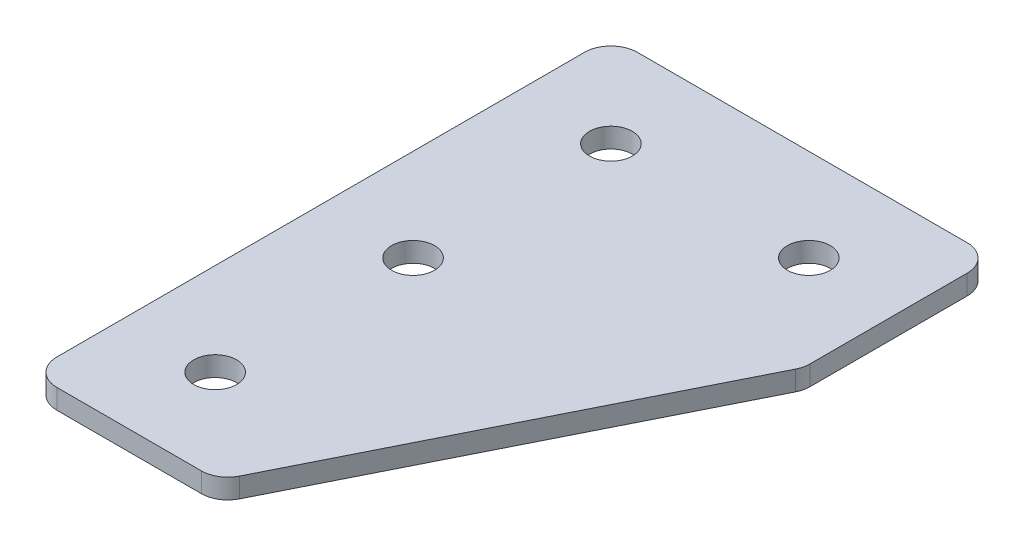
ISO-10303-21;
HEADER;
FILE_DESCRIPTION(('STEP AP214'),'2;1');
FILE_NAME('part.step','',(''),(''),'','','');
FILE_SCHEMA(('AUTOMOTIVE_DESIGN { 1 0 10303 214 1 1 1 1 }'));
ENDSEC;
DATA;
#1=APPLICATION_CONTEXT('core data for automotive mechanical design processes');
#2=APPLICATION_PROTOCOL_DEFINITION('international standard','automotive_design',2000,#1);
#3=PRODUCT_CONTEXT('',#1,'mechanical');
#4=PRODUCT('Part','Part','',(#3));
#5=PRODUCT_RELATED_PRODUCT_CATEGORY('part','',(#4));
#6=PRODUCT_DEFINITION_FORMATION('','',#4);
#7=PRODUCT_DEFINITION_CONTEXT('part definition',#1,'design');
#8=PRODUCT_DEFINITION('design','',#6,#7);
#9=PRODUCT_DEFINITION_SHAPE('','',#8);
#10=(LENGTH_UNIT() NAMED_UNIT(*) SI_UNIT(.MILLI.,.METRE.));
#11=(NAMED_UNIT(*) PLANE_ANGLE_UNIT() SI_UNIT($,.RADIAN.));
#12=(NAMED_UNIT(*) SI_UNIT($,.STERADIAN.) SOLID_ANGLE_UNIT());
#13=UNCERTAINTY_MEASURE_WITH_UNIT(LENGTH_MEASURE(1.E-05),#10,'distance_accuracy_value','');
#14=(GEOMETRIC_REPRESENTATION_CONTEXT(3) GLOBAL_UNCERTAINTY_ASSIGNED_CONTEXT((#13)) GLOBAL_UNIT_ASSIGNED_CONTEXT((#10,
#11,#12)) REPRESENTATION_CONTEXT('',''));
#15=CARTESIAN_POINT('',(0.,0.,0.));
#16=DIRECTION('',(0.,0.,1.));
#17=DIRECTION('',(1.,0.,0.));
#18=AXIS2_PLACEMENT_3D('',#15,#16,#17);
#19=CARTESIAN_POINT('',(-8.92451364331455,1.52470932668439,-15.8498260094711));
#20=DIRECTION('',(0.,-1.,0.));
#21=DIRECTION('',(0.,0.,-1.));
#22=AXIS2_PLACEMENT_3D('',#19,#20,#21);
#23=PLANE('',#22);
#24=CARTESIAN_POINT('',(-8.92451364331456,1.52470932668439,14.1501739905289));
#25=DIRECTION('',(0.,1.,0.));
#26=DIRECTION('',(0.,0.,1.));
#27=AXIS2_PLACEMENT_3D('',#24,#25,#26);
#28=CIRCLE('',#27,1.625);
#29=CARTESIAN_POINT('',(-8.92451364331456,1.52470932668439,15.7751739905289));
#30=VERTEX_POINT('',#29);
#31=EDGE_CURVE('E249',#30,#30,#28,.T.);
#32=ORIENTED_EDGE('',*,*,#31,.T.);
#33=EDGE_LOOP('',(#32));
#34=FACE_BOUND('',#33,.T.);
#35=CARTESIAN_POINT('',(-8.92451364331456,1.52470932668439,-0.849826009471109));
#36=DIRECTION('',(0.,1.,0.));
#37=DIRECTION('',(0.,0.,1.));
#38=AXIS2_PLACEMENT_3D('',#35,#36,#37);
#39=CIRCLE('',#38,1.625);
#40=CARTESIAN_POINT('',(-8.92451364331456,1.52470932668439,0.775173990528891));
#41=VERTEX_POINT('',#40);
#42=EDGE_CURVE('E244',#41,#41,#39,.T.);
#43=ORIENTED_EDGE('',*,*,#42,.T.);
#44=EDGE_LOOP('',(#43));
#45=FACE_BOUND('',#44,.T.);
#46=CARTESIAN_POINT('',(6.07548635668545,1.52470932668439,-15.8498260094711));
#47=DIRECTION('',(0.,1.,0.));
#48=DIRECTION('',(0.,0.,1.));
#49=AXIS2_PLACEMENT_3D('',#46,#47,#48);
#50=CIRCLE('',#49,1.625);
#51=CARTESIAN_POINT('',(6.07548635668545,1.52470932668439,-14.2248260094711));
#52=VERTEX_POINT('',#51);
#53=EDGE_CURVE('E257',#52,#52,#50,.T.);
#54=ORIENTED_EDGE('',*,*,#53,.T.);
#55=EDGE_LOOP('',(#54));
#56=FACE_BOUND('',#55,.T.);
#57=CARTESIAN_POINT('',(-8.92451364331455,1.52470932668439,-15.8498260094711));
#58=DIRECTION('',(0.,1.,0.));
#59=DIRECTION('',(0.,0.,1.));
#60=AXIS2_PLACEMENT_3D('',#57,#58,#59);
#61=CIRCLE('',#60,1.625);
#62=CARTESIAN_POINT('',(-8.92451364331455,1.52470932668439,-14.2248260094711));
#63=VERTEX_POINT('',#62);
#64=EDGE_CURVE('E175',#63,#63,#61,.T.);
#65=ORIENTED_EDGE('',*,*,#64,.T.);
#66=EDGE_LOOP('',(#65));
#67=FACE_BOUND('',#66,.T.);
#68=DIRECTION('',(0.447213595499954,0.,-0.894427190999918));
#69=VECTOR('',#68,1.);
#70=CARTESIAN_POINT('',(-1.7335306376894,1.52470932668439,21.1501739905289));
#71=LINE('',#70,#69);
#72=CARTESIAN_POINT('',(-1.18074423318936,1.52470932668439,20.0446011815288));
#73=VERTEX_POINT('',#72);
#74=CARTESIAN_POINT('',(12.8643407386852,1.52470932668439,-8.04556876222062));
#75=VERTEX_POINT('',#74);
#76=EDGE_CURVE('E121',#73,#75,#71,.T.);
#77=ORIENTED_EDGE('',*,*,#76,.F.);
#78=CARTESIAN_POINT('',(-2.96959861518919,1.52470932668439,19.1501739905289));
#79=DIRECTION('',(0.,-1.,0.));
#80=DIRECTION('',(0.,0.,-1.));
#81=AXIS2_PLACEMENT_3D('',#78,#79,#80);
#82=CIRCLE('',#81,2.);
#83=CARTESIAN_POINT('',(-2.9695986151892,1.52470932668439,21.1501739905289));
#84=VERTEX_POINT('',#83);
#85=EDGE_CURVE('E145',#73,#84,#82,.T.);
#86=ORIENTED_EDGE('',*,*,#85,.T.);
#87=DIRECTION('',(1.,0.,0.));
#88=VECTOR('',#87,1.);
#89=CARTESIAN_POINT('',(-15.9245136433146,1.52470932668439,21.1501739905289));
#90=LINE('',#89,#88);
#91=CARTESIAN_POINT('',(-13.9245136433146,1.52470932668439,21.1501739905289));
#92=VERTEX_POINT('',#91);
#93=EDGE_CURVE('E162',#92,#84,#90,.T.);
#94=ORIENTED_EDGE('',*,*,#93,.F.);
#95=CARTESIAN_POINT('',(-13.9245136433146,1.52470932668439,19.1501739905289));
#96=DIRECTION('',(0.,-1.,0.));
#97=DIRECTION('',(0.,0.,-1.));
#98=AXIS2_PLACEMENT_3D('',#95,#96,#97);
#99=CIRCLE('',#98,2.);
#100=CARTESIAN_POINT('',(-15.9245136433146,1.52470932668439,19.1501739905289));
#101=VERTEX_POINT('',#100);
#102=EDGE_CURVE('E117',#92,#101,#99,.T.);
#103=ORIENTED_EDGE('',*,*,#102,.T.);
#104=DIRECTION('',(0.,0.,1.));
#105=VECTOR('',#104,1.);
#106=CARTESIAN_POINT('',(-15.9245136433146,1.52470932668439,-22.8498260094711));
#107=LINE('',#106,#105);
#108=CARTESIAN_POINT('',(-15.9245136433146,1.52470932668439,-20.8498260094711));
#109=VERTEX_POINT('',#108);
#110=EDGE_CURVE('E160',#109,#101,#107,.T.);
#111=ORIENTED_EDGE('',*,*,#110,.F.);
#112=CARTESIAN_POINT('',(-13.9245136433146,1.52470932668439,-20.8498260094711));
#113=DIRECTION('',(0.,-1.,0.));
#114=DIRECTION('',(0.,0.,-1.));
#115=AXIS2_PLACEMENT_3D('',#112,#113,#114);
#116=CIRCLE('',#115,2.);
#117=CARTESIAN_POINT('',(-13.9245136433146,1.52470932668439,-22.8498260094711));
#118=VERTEX_POINT('',#117);
#119=EDGE_CURVE('E140',#109,#118,#116,.T.);
#120=ORIENTED_EDGE('',*,*,#119,.T.);
#121=DIRECTION('',(-1.,0.,0.));
#122=VECTOR('',#121,1.);
#123=CARTESIAN_POINT('',(13.0754863566854,1.52470932668439,-22.8498260094712));
#124=LINE('',#123,#122);
#125=CARTESIAN_POINT('',(11.0754863566854,1.52470932668439,-22.8498260094712));
#126=VERTEX_POINT('',#125);
#127=EDGE_CURVE('E163',#126,#118,#124,.T.);
#128=ORIENTED_EDGE('',*,*,#127,.F.);
#129=CARTESIAN_POINT('',(11.0754863566854,1.52470932668439,-20.8498260094712));
#130=DIRECTION('',(0.,-1.,0.));
#131=DIRECTION('',(0.,0.,-1.));
#132=AXIS2_PLACEMENT_3D('',#129,#130,#131);
#133=CIRCLE('',#132,2.);
#134=CARTESIAN_POINT('',(13.0754863566854,1.52470932668439,-20.8498260094711));
#135=VERTEX_POINT('',#134);
#136=EDGE_CURVE('E31',#126,#135,#133,.T.);
#137=ORIENTED_EDGE('',*,*,#136,.T.);
#138=DIRECTION('',(0.,0.,-1.));
#139=VECTOR('',#138,1.);
#140=CARTESIAN_POINT('',(13.0754863566854,1.52470932668439,-8.46785999822096));
#141=LINE('',#140,#139);
#142=CARTESIAN_POINT('',(13.0754863566854,1.52470932668439,-8.93999595322053));
#143=VERTEX_POINT('',#142);
#144=EDGE_CURVE('E118',#143,#135,#141,.T.);
#145=ORIENTED_EDGE('',*,*,#144,.F.);
#146=CARTESIAN_POINT('',(11.0754863566854,1.52470932668439,-8.93999595322053));
#147=DIRECTION('',(0.,-1.,0.));
#148=DIRECTION('',(0.,0.,-1.));
#149=AXIS2_PLACEMENT_3D('',#146,#147,#148);
#150=CIRCLE('',#149,2.);
#151=EDGE_CURVE('E143',#143,#75,#150,.T.);
#152=ORIENTED_EDGE('',*,*,#151,.T.);
#153=EDGE_LOOP('',(#77,#86,#94,#103,#111,#120,#128,#137,#145,#152));
#154=FACE_BOUND('',#153,.T.);
#155=ADVANCED_FACE('F16',(#34,#45,#56,#67,#154),#23,.T.);
#156=CARTESIAN_POINT('',(13.0754863566854,1.52470932668439,-22.8498260094712));
#157=DIRECTION('',(0.,0.,-1.));
#158=DIRECTION('',(-1.,0.,0.));
#159=AXIS2_PLACEMENT_3D('',#156,#157,#158);
#160=PLANE('',#159);
#161=DIRECTION('',(-1.,0.,0.));
#162=VECTOR('',#161,1.);
#163=CARTESIAN_POINT('',(13.0754863566854,3.02470932668439,-22.8498260094712));
#164=LINE('',#163,#162);
#165=CARTESIAN_POINT('',(11.0754863566854,3.02470932668439,-22.8498260094712));
#166=VERTEX_POINT('',#165);
#167=CARTESIAN_POINT('',(-13.9245136433146,3.02470932668439,-22.8498260094711));
#168=VERTEX_POINT('',#167);
#169=EDGE_CURVE('E172',#166,#168,#164,.T.);
#170=ORIENTED_EDGE('',*,*,#169,.F.);
#171=DIRECTION('',(0.,1.,0.));
#172=VECTOR('',#171,1.);
#173=CARTESIAN_POINT('',(11.0754863566854,1.52470932668439,-22.8498260094712));
#174=LINE('',#173,#172);
#175=EDGE_CURVE('E154',#166,#126,#174,.F.);
#176=ORIENTED_EDGE('',*,*,#175,.T.);
#177=ORIENTED_EDGE('',*,*,#127,.T.);
#178=DIRECTION('',(0.,1.,0.));
#179=VECTOR('',#178,1.);
#180=CARTESIAN_POINT('',(-13.9245136433146,1.52470932668439,-22.8498260094711));
#181=LINE('',#180,#179);
#182=EDGE_CURVE('E151',#118,#168,#181,.T.);
#183=ORIENTED_EDGE('',*,*,#182,.T.);
#184=EDGE_LOOP('',(#170,#176,#177,#183));
#185=FACE_BOUND('',#184,.T.);
#186=ADVANCED_FACE('F208',(#185),#160,.T.);
#187=CARTESIAN_POINT('',(13.0754863566854,1.52470932668439,-8.46785999822096));
#188=DIRECTION('',(1.,0.,0.));
#189=DIRECTION('',(0.,0.,-1.));
#190=AXIS2_PLACEMENT_3D('',#187,#188,#189);
#191=PLANE('',#190);
#192=DIRECTION('',(0.,0.,-1.));
#193=VECTOR('',#192,1.);
#194=CARTESIAN_POINT('',(13.0754863566854,3.02470932668439,-8.46785999822096));
#195=LINE('',#194,#193);
#196=CARTESIAN_POINT('',(13.0754863566854,3.02470932668439,-8.93999595322053));
#197=VERTEX_POINT('',#196);
#198=CARTESIAN_POINT('',(13.0754863566854,3.02470932668439,-20.8498260094711));
#199=VERTEX_POINT('',#198);
#200=EDGE_CURVE('E124',#197,#199,#195,.T.);
#201=ORIENTED_EDGE('',*,*,#200,.F.);
#202=DIRECTION('',(0.,1.,0.));
#203=VECTOR('',#202,1.);
#204=CARTESIAN_POINT('',(13.0754863566854,1.52470932668439,-8.93999595322053));
#205=LINE('',#204,#203);
#206=EDGE_CURVE('E38',#197,#143,#205,.F.);
#207=ORIENTED_EDGE('',*,*,#206,.T.);
#208=ORIENTED_EDGE('',*,*,#144,.T.);
#209=DIRECTION('',(0.,1.,0.));
#210=VECTOR('',#209,1.);
#211=CARTESIAN_POINT('',(13.0754863566854,1.52470932668439,-20.8498260094712));
#212=LINE('',#211,#210);
#213=EDGE_CURVE('E147',#135,#199,#212,.T.);
#214=ORIENTED_EDGE('',*,*,#213,.T.);
#215=EDGE_LOOP('',(#201,#207,#208,#214));
#216=FACE_BOUND('',#215,.T.);
#217=ADVANCED_FACE('F180',(#216),#191,.T.);
#218=CARTESIAN_POINT('',(-1.7335306376894,1.52470932668439,21.1501739905289));
#219=DIRECTION('',(0.894427190999918,0.,0.447213595499954));
#220=DIRECTION('',(0.447213595499954,0.,-0.894427190999918));
#221=AXIS2_PLACEMENT_3D('',#218,#219,#220);
#222=PLANE('',#221);
#223=DIRECTION('',(0.447213595499954,0.,-0.894427190999918));
#224=VECTOR('',#223,1.);
#225=CARTESIAN_POINT('',(-1.7335306376894,3.02470932668439,21.1501739905289));
#226=LINE('',#225,#224);
#227=CARTESIAN_POINT('',(-1.18074423318936,3.02470932668439,20.0446011815288));
#228=VERTEX_POINT('',#227);
#229=CARTESIAN_POINT('',(12.8643407386852,3.02470932668439,-8.04556876222062));
#230=VERTEX_POINT('',#229);
#231=EDGE_CURVE('E114',#228,#230,#226,.T.);
#232=ORIENTED_EDGE('',*,*,#231,.F.);
#233=DIRECTION('',(0.,1.,0.));
#234=VECTOR('',#233,1.);
#235=CARTESIAN_POINT('',(-1.18074423318936,1.52470932668439,20.0446011815288));
#236=LINE('',#235,#234);
#237=EDGE_CURVE('E137',#228,#73,#236,.F.);
#238=ORIENTED_EDGE('',*,*,#237,.T.);
#239=ORIENTED_EDGE('',*,*,#76,.T.);
#240=DIRECTION('',(0.,1.,0.));
#241=VECTOR('',#240,1.);
#242=CARTESIAN_POINT('',(12.8643407386852,1.52470932668439,-8.04556876222061));
#243=LINE('',#242,#241);
#244=EDGE_CURVE('E134',#75,#230,#243,.T.);
#245=ORIENTED_EDGE('',*,*,#244,.T.);
#246=EDGE_LOOP('',(#232,#238,#239,#245));
#247=FACE_BOUND('',#246,.T.);
#248=ADVANCED_FACE('F189',(#247),#222,.T.);
#249=CARTESIAN_POINT('',(-15.9245136433146,1.52470932668439,21.1501739905289));
#250=DIRECTION('',(0.,0.,1.));
#251=DIRECTION('',(1.,0.,0.));
#252=AXIS2_PLACEMENT_3D('',#249,#250,#251);
#253=PLANE('',#252);
#254=ORIENTED_EDGE('',*,*,#93,.T.);
#255=DIRECTION('',(0.,1.,0.));
#256=VECTOR('',#255,1.);
#257=CARTESIAN_POINT('',(-2.9695986151892,1.52470932668439,21.1501739905289));
#258=LINE('',#257,#256);
#259=CARTESIAN_POINT('',(-2.9695986151892,3.02470932668439,21.1501739905289));
#260=VERTEX_POINT('',#259);
#261=EDGE_CURVE('E105',#84,#260,#258,.T.);
#262=ORIENTED_EDGE('',*,*,#261,.T.);
#263=DIRECTION('',(1.,0.,0.));
#264=VECTOR('',#263,1.);
#265=CARTESIAN_POINT('',(-15.9245136433146,3.02470932668439,21.1501739905289));
#266=LINE('',#265,#264);
#267=CARTESIAN_POINT('',(-13.9245136433146,3.02470932668439,21.1501739905289));
#268=VERTEX_POINT('',#267);
#269=EDGE_CURVE('E97',#268,#260,#266,.T.);
#270=ORIENTED_EDGE('',*,*,#269,.F.);
#271=DIRECTION('',(0.,1.,0.));
#272=VECTOR('',#271,1.);
#273=CARTESIAN_POINT('',(-13.9245136433146,1.52470932668439,21.1501739905289));
#274=LINE('',#273,#272);
#275=EDGE_CURVE('E111',#268,#92,#274,.F.);
#276=ORIENTED_EDGE('',*,*,#275,.T.);
#277=EDGE_LOOP('',(#254,#262,#270,#276));
#278=FACE_BOUND('',#277,.T.);
#279=ADVANCED_FACE('F110',(#278),#253,.T.);
#280=CARTESIAN_POINT('',(-15.9245136433146,1.52470932668439,-22.8498260094711));
#281=DIRECTION('',(-1.,0.,0.));
#282=DIRECTION('',(0.,0.,1.));
#283=AXIS2_PLACEMENT_3D('',#280,#281,#282);
#284=PLANE('',#283);
#285=DIRECTION('',(0.,0.,1.));
#286=VECTOR('',#285,1.);
#287=CARTESIAN_POINT('',(-15.9245136433146,3.02470932668439,-22.8498260094711));
#288=LINE('',#287,#286);
#289=CARTESIAN_POINT('',(-15.9245136433146,3.02470932668439,-20.8498260094711));
#290=VERTEX_POINT('',#289);
#291=CARTESIAN_POINT('',(-15.9245136433146,3.02470932668439,19.1501739905289));
#292=VERTEX_POINT('',#291);
#293=EDGE_CURVE('E99',#290,#292,#288,.T.);
#294=ORIENTED_EDGE('',*,*,#293,.F.);
#295=DIRECTION('',(0.,1.,0.));
#296=VECTOR('',#295,1.);
#297=CARTESIAN_POINT('',(-15.9245136433146,1.52470932668439,-20.8498260094711));
#298=LINE('',#297,#296);
#299=EDGE_CURVE('E10',#290,#109,#298,.F.);
#300=ORIENTED_EDGE('',*,*,#299,.T.);
#301=ORIENTED_EDGE('',*,*,#110,.T.);
#302=DIRECTION('',(0.,1.,0.));
#303=VECTOR('',#302,1.);
#304=CARTESIAN_POINT('',(-15.9245136433146,1.52470932668439,19.1501739905289));
#305=LINE('',#304,#303);
#306=EDGE_CURVE('E24',#101,#292,#305,.T.);
#307=ORIENTED_EDGE('',*,*,#306,.T.);
#308=EDGE_LOOP('',(#294,#300,#301,#307));
#309=FACE_BOUND('',#308,.T.);
#310=ADVANCED_FACE('F157',(#309),#284,.T.);
#311=CARTESIAN_POINT('',(-8.92451364331455,3.02470932668439,-15.8498260094711));
#312=DIRECTION('',(0.,-1.,0.));
#313=DIRECTION('',(0.,0.,-1.));
#314=AXIS2_PLACEMENT_3D('',#311,#312,#313);
#315=PLANE('',#314);
#316=CARTESIAN_POINT('',(-8.92451364331456,3.02470932668439,14.1501739905289));
#317=DIRECTION('',(0.,1.,0.));
#318=DIRECTION('',(0.,0.,1.));
#319=AXIS2_PLACEMENT_3D('',#316,#317,#318);
#320=CIRCLE('',#319,1.625);
#321=CARTESIAN_POINT('',(-8.92451364331456,3.02470932668439,15.7751739905289));
#322=VERTEX_POINT('',#321);
#323=EDGE_CURVE('E253',#322,#322,#320,.T.);
#324=ORIENTED_EDGE('',*,*,#323,.F.);
#325=EDGE_LOOP('',(#324));
#326=FACE_BOUND('',#325,.T.);
#327=CARTESIAN_POINT('',(-8.92451364331456,3.02470932668439,-0.849826009471109));
#328=DIRECTION('',(0.,1.,0.));
#329=DIRECTION('',(0.,0.,1.));
#330=AXIS2_PLACEMENT_3D('',#327,#328,#329);
#331=CIRCLE('',#330,1.625);
#332=CARTESIAN_POINT('',(-8.92451364331456,3.02470932668439,0.775173990528891));
#333=VERTEX_POINT('',#332);
#334=EDGE_CURVE('E247',#333,#333,#331,.T.);
#335=ORIENTED_EDGE('',*,*,#334,.F.);
#336=EDGE_LOOP('',(#335));
#337=FACE_BOUND('',#336,.T.);
#338=CARTESIAN_POINT('',(6.07548635668545,3.02470932668439,-15.8498260094711));
#339=DIRECTION('',(0.,1.,0.));
#340=DIRECTION('',(0.,0.,1.));
#341=AXIS2_PLACEMENT_3D('',#338,#339,#340);
#342=CIRCLE('',#341,1.625);
#343=CARTESIAN_POINT('',(6.07548635668545,3.02470932668439,-14.2248260094711));
#344=VERTEX_POINT('',#343);
#345=EDGE_CURVE('E251',#344,#344,#342,.T.);
#346=ORIENTED_EDGE('',*,*,#345,.F.);
#347=EDGE_LOOP('',(#346));
#348=FACE_BOUND('',#347,.T.);
#349=CARTESIAN_POINT('',(-8.92451364331455,3.02470932668439,-15.8498260094711));
#350=DIRECTION('',(0.,1.,0.));
#351=DIRECTION('',(0.,0.,1.));
#352=AXIS2_PLACEMENT_3D('',#349,#350,#351);
#353=CIRCLE('',#352,1.625);
#354=CARTESIAN_POINT('',(-8.92451364331455,3.02470932668439,-14.2248260094711));
#355=VERTEX_POINT('',#354);
#356=EDGE_CURVE('E260',#355,#355,#353,.T.);
#357=ORIENTED_EDGE('',*,*,#356,.F.);
#358=EDGE_LOOP('',(#357));
#359=FACE_BOUND('',#358,.T.);
#360=ORIENTED_EDGE('',*,*,#269,.T.);
#361=CARTESIAN_POINT('',(-2.96959861518919,3.02470932668439,19.1501739905289));
#362=DIRECTION('',(0.,-1.,0.));
#363=DIRECTION('',(0.,0.,-1.));
#364=AXIS2_PLACEMENT_3D('',#361,#362,#363);
#365=CIRCLE('',#364,2.);
#366=EDGE_CURVE('E132',#260,#228,#365,.F.);
#367=ORIENTED_EDGE('',*,*,#366,.T.);
#368=ORIENTED_EDGE('',*,*,#231,.T.);
#369=CARTESIAN_POINT('',(11.0754863566854,3.02470932668439,-8.93999595322053));
#370=DIRECTION('',(0.,-1.,0.));
#371=DIRECTION('',(0.,0.,-1.));
#372=AXIS2_PLACEMENT_3D('',#369,#370,#371);
#373=CIRCLE('',#372,2.);
#374=EDGE_CURVE('E130',#230,#197,#373,.F.);
#375=ORIENTED_EDGE('',*,*,#374,.T.);
#376=ORIENTED_EDGE('',*,*,#200,.T.);
#377=CARTESIAN_POINT('',(11.0754863566854,3.02470932668439,-20.8498260094712));
#378=DIRECTION('',(0.,-1.,0.));
#379=DIRECTION('',(0.,0.,-1.));
#380=AXIS2_PLACEMENT_3D('',#377,#378,#379);
#381=CIRCLE('',#380,2.);
#382=EDGE_CURVE('E128',#199,#166,#381,.F.);
#383=ORIENTED_EDGE('',*,*,#382,.T.);
#384=ORIENTED_EDGE('',*,*,#169,.T.);
#385=CARTESIAN_POINT('',(-13.9245136433146,3.02470932668439,-20.8498260094711));
#386=DIRECTION('',(0.,-1.,0.));
#387=DIRECTION('',(0.,0.,-1.));
#388=AXIS2_PLACEMENT_3D('',#385,#386,#387);
#389=CIRCLE('',#388,2.);
#390=EDGE_CURVE('E104',#168,#290,#389,.F.);
#391=ORIENTED_EDGE('',*,*,#390,.T.);
#392=ORIENTED_EDGE('',*,*,#293,.T.);
#393=CARTESIAN_POINT('',(-13.9245136433146,3.02470932668439,19.1501739905289));
#394=DIRECTION('',(0.,-1.,0.));
#395=DIRECTION('',(0.,0.,-1.));
#396=AXIS2_PLACEMENT_3D('',#393,#394,#395);
#397=CIRCLE('',#396,2.);
#398=EDGE_CURVE('E94',#292,#268,#397,.F.);
#399=ORIENTED_EDGE('',*,*,#398,.T.);
#400=EDGE_LOOP('',(#360,#367,#368,#375,#376,#383,#384,#391,#392,#399));
#401=FACE_BOUND('',#400,.T.);
#402=ADVANCED_FACE('F96',(#326,#337,#348,#359,#401),#315,.F.);
#403=CARTESIAN_POINT('',(-8.92451364331455,1.52470932668439,-15.8498260094711));
#404=DIRECTION('',(0.,1.,0.));
#405=DIRECTION('',(0.,0.,1.));
#406=AXIS2_PLACEMENT_3D('',#403,#404,#405);
#407=CYLINDRICAL_SURFACE('',#406,1.625);
#408=ORIENTED_EDGE('',*,*,#64,.F.);
#409=EDGE_LOOP('',(#408));
#410=FACE_BOUND('',#409,.T.);
#411=ORIENTED_EDGE('',*,*,#356,.T.);
#412=EDGE_LOOP('',(#411));
#413=FACE_BOUND('',#412,.T.);
#414=ADVANCED_FACE('F219',(#410,#413),#407,.F.);
#415=CARTESIAN_POINT('',(6.07548635668545,1.52470932668439,-15.8498260094711));
#416=DIRECTION('',(0.,1.,0.));
#417=DIRECTION('',(0.,0.,1.));
#418=AXIS2_PLACEMENT_3D('',#415,#416,#417);
#419=CYLINDRICAL_SURFACE('',#418,1.625);
#420=ORIENTED_EDGE('',*,*,#53,.F.);
#421=EDGE_LOOP('',(#420));
#422=FACE_BOUND('',#421,.T.);
#423=ORIENTED_EDGE('',*,*,#345,.T.);
#424=EDGE_LOOP('',(#423));
#425=FACE_BOUND('',#424,.T.);
#426=ADVANCED_FACE('F232',(#422,#425),#419,.F.);
#427=CARTESIAN_POINT('',(-8.92451364331456,1.52470932668439,-0.849826009471109));
#428=DIRECTION('',(0.,1.,0.));
#429=DIRECTION('',(0.,0.,1.));
#430=AXIS2_PLACEMENT_3D('',#427,#428,#429);
#431=CYLINDRICAL_SURFACE('',#430,1.625);
#432=ORIENTED_EDGE('',*,*,#42,.F.);
#433=EDGE_LOOP('',(#432));
#434=FACE_BOUND('',#433,.T.);
#435=ORIENTED_EDGE('',*,*,#334,.T.);
#436=EDGE_LOOP('',(#435));
#437=FACE_BOUND('',#436,.T.);
#438=ADVANCED_FACE('F203',(#434,#437),#431,.F.);
#439=CARTESIAN_POINT('',(-8.92451364331456,1.52470932668439,14.1501739905289));
#440=DIRECTION('',(0.,1.,0.));
#441=DIRECTION('',(0.,0.,1.));
#442=AXIS2_PLACEMENT_3D('',#439,#440,#441);
#443=CYLINDRICAL_SURFACE('',#442,1.625);
#444=ORIENTED_EDGE('',*,*,#31,.F.);
#445=EDGE_LOOP('',(#444));
#446=FACE_BOUND('',#445,.T.);
#447=ORIENTED_EDGE('',*,*,#323,.T.);
#448=EDGE_LOOP('',(#447));
#449=FACE_BOUND('',#448,.T.);
#450=ADVANCED_FACE('F194',(#446,#449),#443,.F.);
#451=CARTESIAN_POINT('',(-2.96959861518919,1.52470932668439,19.1501739905289));
#452=DIRECTION('',(0.,1.,0.));
#453=DIRECTION('',(0.,0.,1.));
#454=AXIS2_PLACEMENT_3D('',#451,#452,#453);
#455=CYLINDRICAL_SURFACE('',#454,2.);
#456=ORIENTED_EDGE('',*,*,#85,.F.);
#457=ORIENTED_EDGE('',*,*,#237,.F.);
#458=ORIENTED_EDGE('',*,*,#366,.F.);
#459=ORIENTED_EDGE('',*,*,#261,.F.);
#460=EDGE_LOOP('',(#456,#457,#458,#459));
#461=FACE_BOUND('',#460,.T.);
#462=ADVANCED_FACE('F192',(#461),#455,.T.);
#463=CARTESIAN_POINT('',(11.0754863566854,1.52470932668439,-8.93999595322053));
#464=DIRECTION('',(0.,1.,0.));
#465=DIRECTION('',(0.,0.,1.));
#466=AXIS2_PLACEMENT_3D('',#463,#464,#465);
#467=CYLINDRICAL_SURFACE('',#466,2.);
#468=ORIENTED_EDGE('',*,*,#151,.F.);
#469=ORIENTED_EDGE('',*,*,#206,.F.);
#470=ORIENTED_EDGE('',*,*,#374,.F.);
#471=ORIENTED_EDGE('',*,*,#244,.F.);
#472=EDGE_LOOP('',(#468,#469,#470,#471));
#473=FACE_BOUND('',#472,.T.);
#474=ADVANCED_FACE('F184',(#473),#467,.T.);
#475=CARTESIAN_POINT('',(11.0754863566854,1.52470932668439,-20.8498260094712));
#476=DIRECTION('',(0.,1.,0.));
#477=DIRECTION('',(0.,0.,1.));
#478=AXIS2_PLACEMENT_3D('',#475,#476,#477);
#479=CYLINDRICAL_SURFACE('',#478,2.);
#480=ORIENTED_EDGE('',*,*,#136,.F.);
#481=ORIENTED_EDGE('',*,*,#175,.F.);
#482=ORIENTED_EDGE('',*,*,#382,.F.);
#483=ORIENTED_EDGE('',*,*,#213,.F.);
#484=EDGE_LOOP('',(#480,#481,#482,#483));
#485=FACE_BOUND('',#484,.T.);
#486=ADVANCED_FACE('F201',(#485),#479,.T.);
#487=CARTESIAN_POINT('',(-13.9245136433146,1.52470932668439,-20.8498260094711));
#488=DIRECTION('',(0.,1.,0.));
#489=DIRECTION('',(0.,0.,1.));
#490=AXIS2_PLACEMENT_3D('',#487,#488,#489);
#491=CYLINDRICAL_SURFACE('',#490,2.);
#492=ORIENTED_EDGE('',*,*,#119,.F.);
#493=ORIENTED_EDGE('',*,*,#299,.F.);
#494=ORIENTED_EDGE('',*,*,#390,.F.);
#495=ORIENTED_EDGE('',*,*,#182,.F.);
#496=EDGE_LOOP('',(#492,#493,#494,#495));
#497=FACE_BOUND('',#496,.T.);
#498=ADVANCED_FACE('F309',(#497),#491,.T.);
#499=CARTESIAN_POINT('',(-13.9245136433146,1.52470932668439,19.1501739905289));
#500=DIRECTION('',(0.,1.,0.));
#501=DIRECTION('',(0.,0.,1.));
#502=AXIS2_PLACEMENT_3D('',#499,#500,#501);
#503=CYLINDRICAL_SURFACE('',#502,2.);
#504=ORIENTED_EDGE('',*,*,#102,.F.);
#505=ORIENTED_EDGE('',*,*,#275,.F.);
#506=ORIENTED_EDGE('',*,*,#398,.F.);
#507=ORIENTED_EDGE('',*,*,#306,.F.);
#508=EDGE_LOOP('',(#504,#505,#506,#507));
#509=FACE_BOUND('',#508,.T.);
#510=ADVANCED_FACE('F18',(#509),#503,.T.);
#511=CLOSED_SHELL('',(#155,#186,#217,#248,#279,#310,#402,#414,#426,#438,#450,#462,#474,#486,
#498,#510));
#512=MANIFOLD_SOLID_BREP('B1',#511);
#513=ADVANCED_BREP_SHAPE_REPRESENTATION('',(#18,#512),#14);
#514=SHAPE_DEFINITION_REPRESENTATION(#9,#513);
ENDSEC;
END-ISO-10303-21;
